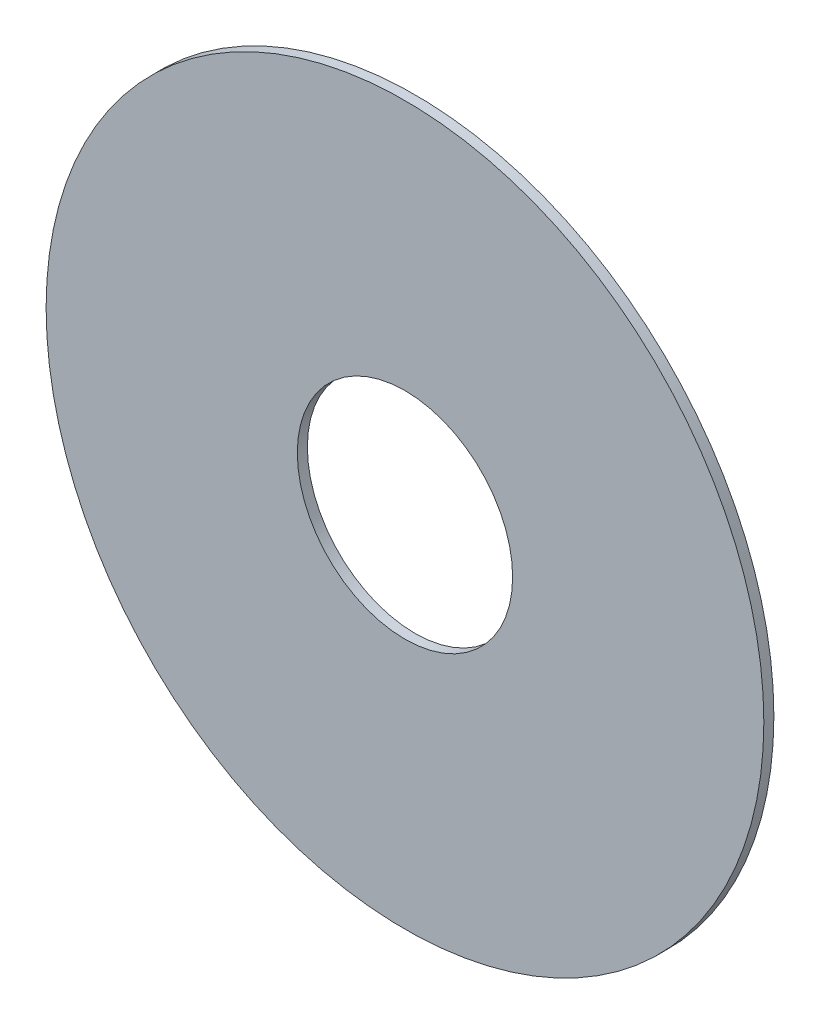
ISO-10303-21;
HEADER;
FILE_DESCRIPTION(('STEP AP214'),'2;1');
FILE_NAME('part.step','',(''),(''),'','','');
FILE_SCHEMA(('AUTOMOTIVE_DESIGN { 1 0 10303 214 1 1 1 1 }'));
ENDSEC;
DATA;
#1=APPLICATION_CONTEXT('core data for automotive mechanical design processes');
#2=APPLICATION_PROTOCOL_DEFINITION('international standard','automotive_design',2000,#1);
#3=PRODUCT_CONTEXT('',#1,'mechanical');
#4=PRODUCT('Part','Part','',(#3));
#5=PRODUCT_RELATED_PRODUCT_CATEGORY('part','',(#4));
#6=PRODUCT_DEFINITION_FORMATION('','',#4);
#7=PRODUCT_DEFINITION_CONTEXT('part definition',#1,'design');
#8=PRODUCT_DEFINITION('design','',#6,#7);
#9=PRODUCT_DEFINITION_SHAPE('','',#8);
#10=(LENGTH_UNIT() NAMED_UNIT(*) SI_UNIT(.MILLI.,.METRE.));
#11=(NAMED_UNIT(*) PLANE_ANGLE_UNIT() SI_UNIT($,.RADIAN.));
#12=(NAMED_UNIT(*) SI_UNIT($,.STERADIAN.) SOLID_ANGLE_UNIT());
#13=UNCERTAINTY_MEASURE_WITH_UNIT(LENGTH_MEASURE(1.E-05),#10,'distance_accuracy_value','');
#14=(GEOMETRIC_REPRESENTATION_CONTEXT(3) GLOBAL_UNCERTAINTY_ASSIGNED_CONTEXT((#13)) GLOBAL_UNIT_ASSIGNED_CONTEXT((#10,
#11,#12)) REPRESENTATION_CONTEXT('',''));
#15=CARTESIAN_POINT('',(0.,0.,0.));
#16=DIRECTION('',(0.,0.,1.));
#17=DIRECTION('',(1.,0.,0.));
#18=AXIS2_PLACEMENT_3D('',#15,#16,#17);
#19=CARTESIAN_POINT('',(176.276,-105.664,-0.045));
#20=DIRECTION('',(0.,0.,-1.));
#21=DIRECTION('',(0.,-1.,0.));
#22=AXIS2_PLACEMENT_3D('',#19,#20,#21);
#23=CYLINDRICAL_SURFACE('',#22,0.375);
#24=CARTESIAN_POINT('',(176.276,-105.664,1.67));
#25=DIRECTION('',(0.,0.,-1.));
#26=DIRECTION('',(0.,-1.,0.));
#27=AXIS2_PLACEMENT_3D('',#24,#25,#26);
#28=CIRCLE('',#27,0.375);
#29=CARTESIAN_POINT('',(176.276,-106.039,1.67));
#30=VERTEX_POINT('',#29);
#31=EDGE_CURVE('E20',#30,#30,#28,.T.);
#32=ORIENTED_EDGE('',*,*,#31,.T.);
#33=DIRECTION('',(0.,0.,1.));
#34=VECTOR('',#33,1.);
#35=CARTESIAN_POINT('',(176.276,-106.039,-0.045));
#36=LINE('',#35,#34);
#37=CARTESIAN_POINT('',(176.276,-106.039,1.705));
#38=VERTEX_POINT('',#37);
#39=EDGE_CURVE('E11',#30,#38,#36,.T.);
#40=ORIENTED_EDGE('',*,*,#39,.T.);
#41=CARTESIAN_POINT('',(176.276,-105.664,1.705));
#42=DIRECTION('',(0.,0.,-1.));
#43=DIRECTION('',(0.,-1.,0.));
#44=AXIS2_PLACEMENT_3D('',#41,#42,#43);
#45=CIRCLE('',#44,0.375);
#46=EDGE_CURVE('E69',#38,#38,#45,.T.);
#47=ORIENTED_EDGE('',*,*,#46,.F.);
#48=ORIENTED_EDGE('',*,*,#39,.F.);
#49=EDGE_LOOP('',(#32,#40,#47,#48));
#50=FACE_BOUND('',#49,.T.);
#51=ADVANCED_FACE('F17',(#50),#23,.F.);
#52=CARTESIAN_POINT('',(176.276,-105.664,1.67));
#53=DIRECTION('',(0.,0.,1.));
#54=DIRECTION('',(1.,0.,0.));
#55=AXIS2_PLACEMENT_3D('',#52,#53,#54);
#56=PLANE('',#55);
#57=ORIENTED_EDGE('',*,*,#31,.F.);
#58=EDGE_LOOP('',(#57));
#59=FACE_BOUND('',#58,.T.);
#60=CARTESIAN_POINT('',(176.276,-105.664,1.67));
#61=DIRECTION('',(0.,0.,1.));
#62=DIRECTION('',(1.,0.,0.));
#63=AXIS2_PLACEMENT_3D('',#60,#61,#62);
#64=CIRCLE('',#63,1.25);
#65=CARTESIAN_POINT('',(177.526,-105.664,1.67));
#66=VERTEX_POINT('',#65);
#67=EDGE_CURVE('E57',#66,#66,#64,.T.);
#68=ORIENTED_EDGE('',*,*,#67,.F.);
#69=EDGE_LOOP('',(#68));
#70=FACE_BOUND('',#69,.T.);
#71=ADVANCED_FACE('F79',(#59,#70),#56,.F.);
#72=CARTESIAN_POINT('',(176.276,-105.664,1.705));
#73=DIRECTION('',(0.,0.,1.));
#74=DIRECTION('',(1.,0.,0.));
#75=AXIS2_PLACEMENT_3D('',#72,#73,#74);
#76=PLANE('',#75);
#77=ORIENTED_EDGE('',*,*,#46,.T.);
#78=EDGE_LOOP('',(#77));
#79=FACE_BOUND('',#78,.T.);
#80=CARTESIAN_POINT('',(176.276,-105.664,1.705));
#81=DIRECTION('',(0.,0.,1.));
#82=DIRECTION('',(1.,0.,0.));
#83=AXIS2_PLACEMENT_3D('',#80,#81,#82);
#84=CIRCLE('',#83,1.25);
#85=CARTESIAN_POINT('',(177.526,-105.664,1.705));
#86=VERTEX_POINT('',#85);
#87=EDGE_CURVE('E55',#86,#86,#84,.T.);
#88=ORIENTED_EDGE('',*,*,#87,.T.);
#89=EDGE_LOOP('',(#88));
#90=FACE_BOUND('',#89,.T.);
#91=ADVANCED_FACE('F61',(#79,#90),#76,.T.);
#92=CARTESIAN_POINT('',(176.276,-105.664,1.67));
#93=DIRECTION('',(0.,0.,1.));
#94=DIRECTION('',(1.,0.,0.));
#95=AXIS2_PLACEMENT_3D('',#92,#93,#94);
#96=CYLINDRICAL_SURFACE('',#95,1.25);
#97=ORIENTED_EDGE('',*,*,#87,.F.);
#98=DIRECTION('',(0.,0.,1.));
#99=VECTOR('',#98,1.);
#100=CARTESIAN_POINT('',(177.526,-105.664,1.67));
#101=LINE('',#100,#99);
#102=EDGE_CURVE('E52',#66,#86,#101,.T.);
#103=ORIENTED_EDGE('',*,*,#102,.F.);
#104=ORIENTED_EDGE('',*,*,#67,.T.);
#105=ORIENTED_EDGE('',*,*,#102,.T.);
#106=EDGE_LOOP('',(#97,#103,#104,#105));
#107=FACE_BOUND('',#106,.T.);
#108=ADVANCED_FACE('F54',(#107),#96,.T.);
#109=CLOSED_SHELL('',(#51,#71,#91,#108));
#110=MANIFOLD_SOLID_BREP('B1',#109);
#111=ADVANCED_BREP_SHAPE_REPRESENTATION('',(#18,#110),#14);
#112=SHAPE_DEFINITION_REPRESENTATION(#9,#111);
ENDSEC;
END-ISO-10303-21;
